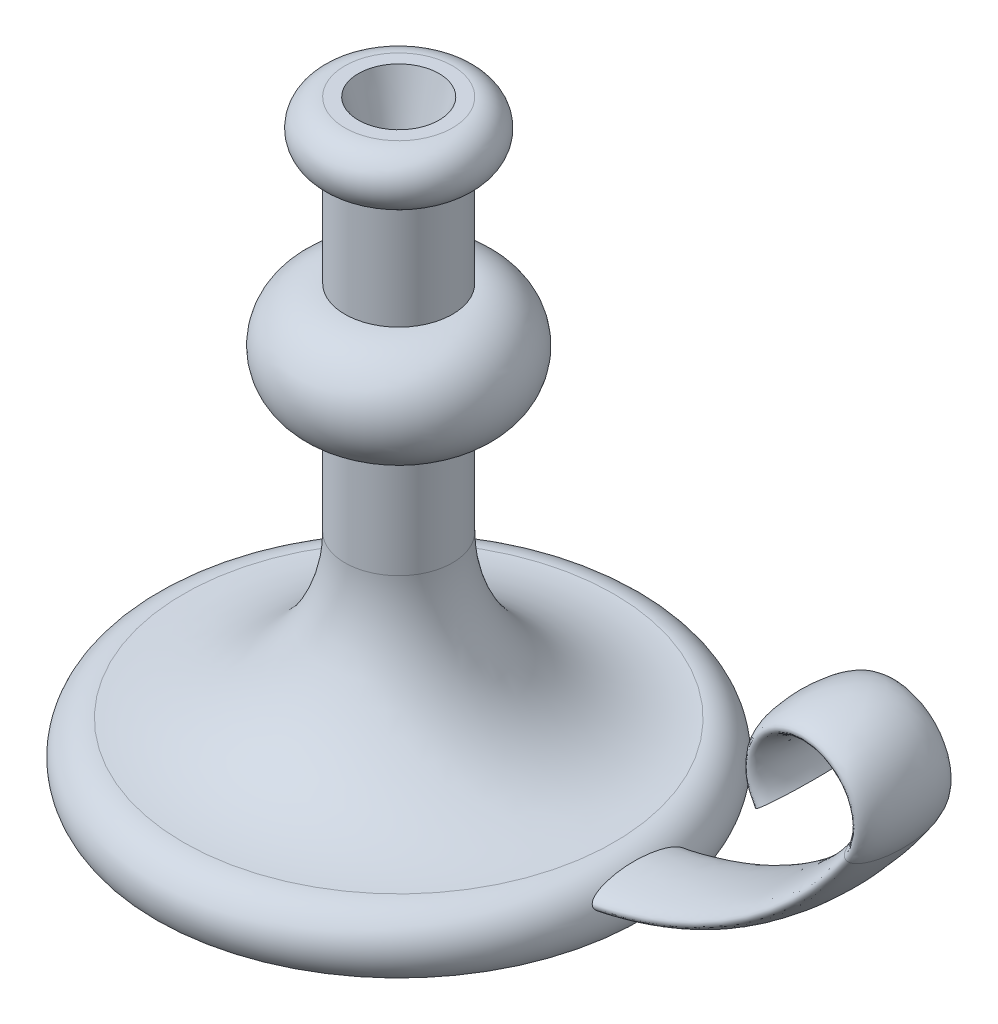
ISO-10303-21;
HEADER;
FILE_DESCRIPTION(('STEP AP214'),'2;1');
FILE_NAME('part.step','',(''),(''),'','','');
FILE_SCHEMA(('AUTOMOTIVE_DESIGN { 1 0 10303 214 1 1 1 1 }'));
ENDSEC;
DATA;
#1=APPLICATION_CONTEXT('core data for automotive mechanical design processes');
#2=APPLICATION_PROTOCOL_DEFINITION('international standard','automotive_design',2000,#1);
#3=PRODUCT_CONTEXT('',#1,'mechanical');
#4=PRODUCT('Part','Part','',(#3));
#5=PRODUCT_RELATED_PRODUCT_CATEGORY('part','',(#4));
#6=PRODUCT_DEFINITION_FORMATION('','',#4);
#7=PRODUCT_DEFINITION_CONTEXT('part definition',#1,'design');
#8=PRODUCT_DEFINITION('design','',#6,#7);
#9=PRODUCT_DEFINITION_SHAPE('','',#8);
#10=(LENGTH_UNIT() NAMED_UNIT(*) SI_UNIT(.MILLI.,.METRE.));
#11=(NAMED_UNIT(*) PLANE_ANGLE_UNIT() SI_UNIT($,.RADIAN.));
#12=(NAMED_UNIT(*) SI_UNIT($,.STERADIAN.) SOLID_ANGLE_UNIT());
#13=UNCERTAINTY_MEASURE_WITH_UNIT(LENGTH_MEASURE(1.E-05),#10,'distance_accuracy_value','');
#14=(GEOMETRIC_REPRESENTATION_CONTEXT(3) GLOBAL_UNCERTAINTY_ASSIGNED_CONTEXT((#13)) GLOBAL_UNIT_ASSIGNED_CONTEXT((#10,
#11,#12)) REPRESENTATION_CONTEXT('',''));
#15=CARTESIAN_POINT('',(0.,0.,0.));
#16=DIRECTION('',(0.,0.,1.));
#17=DIRECTION('',(1.,0.,0.));
#18=AXIS2_PLACEMENT_3D('',#15,#16,#17);
#19=CARTESIAN_POINT('',(0.,0.,0.));
#20=DIRECTION('',(0.,-1.,0.));
#21=DIRECTION('',(0.,0.,-1.));
#22=AXIS2_PLACEMENT_3D('',#19,#20,#21);
#23=PLANE('',#22);
#24=CARTESIAN_POINT('',(0.,0.,0.));
#25=DIRECTION('',(0.,-1.,0.));
#26=DIRECTION('',(0.,0.,-1.));
#27=AXIS2_PLACEMENT_3D('',#24,#25,#26);
#28=CIRCLE('',#27,90.);
#29=CARTESIAN_POINT('',(0.,0.,-90.));
#30=VERTEX_POINT('',#29);
#31=EDGE_CURVE('E76',#30,#30,#28,.T.);
#32=ORIENTED_EDGE('',*,*,#31,.T.);
#33=EDGE_LOOP('',(#32));
#34=FACE_BOUND('',#33,.T.);
#35=ADVANCED_FACE('F36',(#34),#23,.T.);
#36=CARTESIAN_POINT('',(0.,220.,0.));
#37=DIRECTION('',(0.,1.,0.));
#38=DIRECTION('',(0.,0.,1.));
#39=AXIS2_PLACEMENT_3D('',#36,#37,#38);
#40=PLANE('',#39);
#41=CARTESIAN_POINT('',(0.,220.,0.));
#42=DIRECTION('',(0.,1.,0.));
#43=DIRECTION('',(0.,0.,1.));
#44=AXIS2_PLACEMENT_3D('',#41,#42,#43);
#45=CIRCLE('',#44,15.);
#46=CARTESIAN_POINT('',(0.,220.,15.));
#47=VERTEX_POINT('',#46);
#48=EDGE_CURVE('E92',#47,#47,#45,.T.);
#49=ORIENTED_EDGE('',*,*,#48,.F.);
#50=EDGE_LOOP('',(#49));
#51=FACE_BOUND('',#50,.T.);
#52=CARTESIAN_POINT('',(0.,220.,0.));
#53=DIRECTION('',(0.,-1.,0.));
#54=DIRECTION('',(0.,0.,-1.));
#55=AXIS2_PLACEMENT_3D('',#52,#53,#54);
#56=CIRCLE('',#55,20.);
#57=CARTESIAN_POINT('',(0.,220.,-20.));
#58=VERTEX_POINT('',#57);
#59=EDGE_CURVE('E48',#58,#58,#56,.T.);
#60=ORIENTED_EDGE('',*,*,#59,.F.);
#61=EDGE_LOOP('',(#60));
#62=FACE_BOUND('',#61,.T.);
#63=ADVANCED_FACE('F99',(#51,#62),#40,.T.);
#64=CARTESIAN_POINT('',(0.,210.,0.));
#65=DIRECTION('',(0.,-1.,0.));
#66=DIRECTION('',(0.,0.,-1.));
#67=AXIS2_PLACEMENT_3D('',#64,#65,#66);
#68=TOROIDAL_SURFACE('',#67,20.,9.99999999999999);
#69=ORIENTED_EDGE('',*,*,#59,.T.);
#70=EDGE_LOOP('',(#69));
#71=FACE_BOUND('',#70,.T.);
#72=CARTESIAN_POINT('',(0.,200.,0.));
#73=DIRECTION('',(0.,-1.,0.));
#74=DIRECTION('',(0.,0.,-1.));
#75=AXIS2_PLACEMENT_3D('',#72,#73,#74);
#76=CIRCLE('',#75,20.);
#77=CARTESIAN_POINT('',(0.,200.,-20.));
#78=VERTEX_POINT('',#77);
#79=EDGE_CURVE('E53',#78,#78,#76,.T.);
#80=ORIENTED_EDGE('',*,*,#79,.F.);
#81=EDGE_LOOP('',(#80));
#82=FACE_BOUND('',#81,.T.);
#83=ADVANCED_FACE('F102',(#71,#82),#68,.T.);
#84=CARTESIAN_POINT('',(0.,0.,0.));
#85=DIRECTION('',(0.,-1.,0.));
#86=DIRECTION('',(0.,0.,-1.));
#87=AXIS2_PLACEMENT_3D('',#84,#85,#86);
#88=CYLINDRICAL_SURFACE('',#87,20.);
#89=ORIENTED_EDGE('',*,*,#79,.T.);
#90=EDGE_LOOP('',(#89));
#91=FACE_BOUND('',#90,.T.);
#92=CARTESIAN_POINT('',(0.,160.,0.));
#93=DIRECTION('',(0.,-1.,0.));
#94=DIRECTION('',(0.,0.,-1.));
#95=AXIS2_PLACEMENT_3D('',#92,#93,#94);
#96=CIRCLE('',#95,20.);
#97=CARTESIAN_POINT('',(0.,160.,-20.));
#98=VERTEX_POINT('',#97);
#99=EDGE_CURVE('E58',#98,#98,#96,.T.);
#100=ORIENTED_EDGE('',*,*,#99,.F.);
#101=EDGE_LOOP('',(#100));
#102=FACE_BOUND('',#101,.T.);
#103=ADVANCED_FACE('F107',(#91,#102),#88,.T.);
#104=CARTESIAN_POINT('',(0.,140.,0.));
#105=DIRECTION('',(0.,-1.,0.));
#106=DIRECTION('',(0.,0.,-1.));
#107=AXIS2_PLACEMENT_3D('',#104,#105,#106);
#108=TOROIDAL_SURFACE('',#107,20.,20.);
#109=ORIENTED_EDGE('',*,*,#99,.T.);
#110=EDGE_LOOP('',(#109));
#111=FACE_BOUND('',#110,.T.);
#112=CARTESIAN_POINT('',(0.,120.,0.));
#113=DIRECTION('',(0.,-1.,0.));
#114=DIRECTION('',(0.,0.,-1.));
#115=AXIS2_PLACEMENT_3D('',#112,#113,#114);
#116=CIRCLE('',#115,20.);
#117=CARTESIAN_POINT('',(0.,120.,-20.));
#118=VERTEX_POINT('',#117);
#119=EDGE_CURVE('E64',#118,#118,#116,.T.);
#120=ORIENTED_EDGE('',*,*,#119,.F.);
#121=EDGE_LOOP('',(#120));
#122=FACE_BOUND('',#121,.T.);
#123=ADVANCED_FACE('F113',(#111,#122),#108,.T.);
#124=CARTESIAN_POINT('',(0.,0.,0.));
#125=DIRECTION('',(0.,-1.,0.));
#126=DIRECTION('',(0.,0.,-1.));
#127=AXIS2_PLACEMENT_3D('',#124,#125,#126);
#128=CYLINDRICAL_SURFACE('',#127,20.);
#129=ORIENTED_EDGE('',*,*,#119,.T.);
#130=EDGE_LOOP('',(#129));
#131=FACE_BOUND('',#130,.T.);
#132=CARTESIAN_POINT('',(0.,80.,0.));
#133=DIRECTION('',(0.,-1.,0.));
#134=DIRECTION('',(0.,0.,-1.));
#135=AXIS2_PLACEMENT_3D('',#132,#133,#134);
#136=CIRCLE('',#135,20.);
#137=CARTESIAN_POINT('',(0.,80.,-20.));
#138=VERTEX_POINT('',#137);
#139=EDGE_CURVE('E68',#138,#138,#136,.T.);
#140=ORIENTED_EDGE('',*,*,#139,.F.);
#141=EDGE_LOOP('',(#140));
#142=FACE_BOUND('',#141,.T.);
#143=ADVANCED_FACE('F117',(#131,#142),#128,.T.);
#144=CARTESIAN_POINT('',(0.,80.,0.));
#145=DIRECTION('',(0.,-1.,0.));
#146=DIRECTION('',(0.,0.,-1.));
#147=AXIS2_PLACEMENT_3D('',#144,#145,#146);
#148=TOROIDAL_SURFACE('',#147,80.,60.);
#149=ORIENTED_EDGE('',*,*,#139,.T.);
#150=EDGE_LOOP('',(#149));
#151=FACE_BOUND('',#150,.T.);
#152=CARTESIAN_POINT('',(0.,20.,0.));
#153=DIRECTION('',(0.,-1.,0.));
#154=DIRECTION('',(0.,0.,-1.));
#155=AXIS2_PLACEMENT_3D('',#152,#153,#154);
#156=CIRCLE('',#155,80.);
#157=CARTESIAN_POINT('',(0.,20.,-80.));
#158=VERTEX_POINT('',#157);
#159=EDGE_CURVE('E72',#158,#158,#156,.T.);
#160=ORIENTED_EDGE('',*,*,#159,.F.);
#161=EDGE_LOOP('',(#160));
#162=FACE_BOUND('',#161,.T.);
#163=ADVANCED_FACE('F121',(#151,#162),#148,.F.);
#164=CARTESIAN_POINT('',(0.,7.50000000000004,0.));
#165=DIRECTION('',(0.,-1.,0.));
#166=DIRECTION('',(0.,0.,-1.));
#167=AXIS2_PLACEMENT_3D('',#164,#165,#166);
#168=TOROIDAL_SURFACE('',#167,80.,12.5);
#169=CARTESIAN_POINT('',(89.5597422043342,12.9414346567555,17.5));
#170=CARTESIAN_POINT('',(89.5807278946486,12.8988393157081,17.5000019534777));
#171=CARTESIAN_POINT('',(89.6018125795404,12.8563039357769,17.4977816975197));
#172=CARTESIAN_POINT('',(89.6440155813563,12.7716938339371,17.489002543543));
#173=CARTESIAN_POINT('',(89.6651339056647,12.7296192360718,17.4824425050804));
#174=CARTESIAN_POINT('',(89.7283289297819,12.6045076597417,17.4565216692095));
#175=CARTESIAN_POINT('',(89.7702246464785,12.5226255894255,17.4309204730636));
#176=CARTESIAN_POINT('',(89.8644276523311,12.3407735771966,17.3563532007827));
#177=CARTESIAN_POINT('',(89.9162117483189,12.242484901666,17.3027527423027));
#178=CARTESIAN_POINT('',(90.0163878681401,12.0551458272008,17.178826321144));
#179=CARTESIAN_POINT('',(90.0647710548457,11.966119226993,17.1084587296403));
#180=CARTESIAN_POINT('',(90.1524531790239,11.806984522925,16.9652391551481));
#181=CARTESIAN_POINT('',(90.1921458014336,11.7358878994478,16.8936963434585));
#182=CARTESIAN_POINT('',(90.2690886261224,11.5996259068224,16.7438969488311));
#183=CARTESIAN_POINT('',(90.3063367280021,11.5344656201532,16.665634722265));
#184=CARTESIAN_POINT('',(90.3786756485819,11.4092540815105,16.5039763875564));
#185=CARTESIAN_POINT('',(90.4137624747614,11.349212210629,16.4205713158718));
#186=CARTESIAN_POINT('',(90.4819450166471,11.2336894025401,16.2499454917114));
#187=CARTESIAN_POINT('',(90.5150413047902,11.1782071523834,16.162725848809));
#188=CARTESIAN_POINT('',(90.5839705930101,11.0637251825689,15.9728919395736));
#189=CARTESIAN_POINT('',(90.6195406839562,11.0053156128849,15.8698282905887));
#190=CARTESIAN_POINT('',(90.6886668526269,10.8929143897208,15.6606649910658));
#191=CARTESIAN_POINT('',(90.7222226971282,10.8389232475745,15.5545649910506));
#192=CARTESIAN_POINT('',(90.787486486134,10.7348751403119,15.3401290691865));
#193=CARTESIAN_POINT('',(90.8191972688173,10.6848120890841,15.2317969483067));
#194=CARTESIAN_POINT('',(90.881005962979,10.5880683385414,15.0131968985225));
#195=CARTESIAN_POINT('',(90.9111039714558,10.5413874357516,14.9029290865686));
#196=CARTESIAN_POINT('',(90.9798973633521,10.4355491517098,14.6427529331226));
#197=CARTESIAN_POINT('',(91.0180072010884,10.377593665576,14.4922012075481));
#198=CARTESIAN_POINT('',(91.091887555317,10.2663462891692,14.1888070722871));
#199=CARTESIAN_POINT('',(91.1276577411367,10.2130550577559,14.0359643425398));
#200=CARTESIAN_POINT('',(91.1971197458645,10.1105127689612,13.7282685712581));
#201=CARTESIAN_POINT('',(91.2308091946811,10.0612662985098,13.573413471871));
#202=CARTESIAN_POINT('',(91.2962483962878,9.96642044574798,13.262180104172));
#203=CARTESIAN_POINT('',(91.3279980241889,9.92082129819992,13.1058017385396));
#204=CARTESIAN_POINT('',(91.4205951755327,9.78887458660799,12.6346162266685));
#205=CARTESIAN_POINT('',(91.4787589060981,9.70742476979595,12.3179025042442));
#206=CARTESIAN_POINT('',(91.5890957852254,9.55493826130152,11.6792188898602));
#207=CARTESIAN_POINT('',(91.641236506382,9.48395741425906,11.357230318611));
#208=CARTESIAN_POINT('',(91.7397682682944,9.35136221163197,10.7107316640823));
#209=CARTESIAN_POINT('',(91.7861636672357,9.28974074823245,10.3862236929834));
#210=CARTESIAN_POINT('',(91.8736976604511,9.17463718318053,9.73512886653571));
#211=CARTESIAN_POINT('',(91.9148370779327,9.12115380666537,9.40854234516816));
#212=CARTESIAN_POINT('',(91.9930777751443,9.02031209920319,8.74630339912615));
#213=CARTESIAN_POINT('',(92.0300669877613,8.9731192113716,8.41061269264338));
#214=CARTESIAN_POINT('',(92.0991833927575,8.88559842477435,7.73783252743946));
#215=CARTESIAN_POINT('',(92.1313104056236,8.84527077946752,7.40074301754612));
#216=CARTESIAN_POINT('',(92.1909161961866,8.77092313439269,6.72537142355346));
#217=CARTESIAN_POINT('',(92.2183937480205,8.73690479789183,6.38708904887192));
#218=CARTESIAN_POINT('',(92.2688480816039,8.67476840304501,5.70964427774291));
#219=CARTESIAN_POINT('',(92.2918247141674,8.64665054027193,5.37048185250299));
#220=CARTESIAN_POINT('',(92.3540877228587,8.57076604630488,4.35367181244669));
#221=CARTESIAN_POINT('',(92.3868571977359,8.53128338370556,3.67498389641647));
#222=CARTESIAN_POINT('',(92.4356134743347,8.47274161832896,2.3161471150407));
#223=CARTESIAN_POINT('',(92.4515998737813,8.45368300509716,1.63599821506823));
#224=CARTESIAN_POINT('',(92.4661200478781,8.43637339284855,0.357955102331944));
#225=CARTESIAN_POINT('',(92.4665389208555,8.43587490179708,-0.239888856143656));
#226=CARTESIAN_POINT('',(92.4546362797528,8.4500624126083,-1.43536153859164));
#227=CARTESIAN_POINT('',(92.4423128974783,8.46475064105845,-2.03299021814842));
#228=CARTESIAN_POINT('',(92.4047541650815,8.5097668077993,-3.22745109478543));
#229=CARTESIAN_POINT('',(92.379514731688,8.54009969200438,-3.82428298010724));
#230=CARTESIAN_POINT('',(92.3157217367253,8.61743320229677,-5.0169460623326));
#231=CARTESIAN_POINT('',(92.2771508465328,8.66445552395921,-5.6127749375613));
#232=CARTESIAN_POINT('',(92.1861026743767,8.77678784246257,-6.80153886380939));
#233=CARTESIAN_POINT('',(92.1336290020919,8.842093092625,-7.39447462535091));
#234=CARTESIAN_POINT('',(92.0437550848418,8.95574227206712,-8.28055229820513));
#235=CARTESIAN_POINT('',(92.0119455213755,8.99622894552014,-8.57528682166726));
#236=CARTESIAN_POINT('',(91.9444204496405,9.08291539794889,-9.16346094428884));
#237=CARTESIAN_POINT('',(91.9087051114866,9.12911492811459,-9.45690059926715));
#238=CARTESIAN_POINT('',(91.8331309715698,9.2278292933407,-10.0422906036683));
#239=CARTESIAN_POINT('',(91.7932707518514,9.28034629056384,-10.3342404073468));
#240=CARTESIAN_POINT('',(91.709117916737,9.39245062081631,-10.9161852811052));
#241=CARTESIAN_POINT('',(91.6648247441272,9.45203884286031,-11.2061801005452));
#242=CARTESIAN_POINT('',(91.5713925727481,9.57931645333881,-11.7838191658168));
#243=CARTESIAN_POINT('',(91.5222504482682,9.64701107336926,-12.0714617643072));
#244=CARTESIAN_POINT('',(91.4186796874406,9.79172730085907,-12.6430805537631));
#245=CARTESIAN_POINT('',(91.3642572573635,9.86873798424095,-12.9270606150355));
#246=CARTESIAN_POINT('',(91.2493765391175,10.033952974788,-13.4904217181466));
#247=CARTESIAN_POINT('',(91.1889212109097,10.1221517983454,-13.7698049377448));
#248=CARTESIAN_POINT('',(91.0929373870874,10.2648274882363,-14.1839125047646));
#249=CARTESIAN_POINT('',(91.0600757486262,10.3140904181849,-14.3210581267386));
#250=CARTESIAN_POINT('',(90.9923938569386,10.4165511027192,-14.5933763477649));
#251=CARTESIAN_POINT('',(90.9575737807137,10.4697485018484,-14.7285491237344));
#252=CARTESIAN_POINT('',(90.8810851838777,10.5878451344079,-15.0138774923677));
#253=CARTESIAN_POINT('',(90.8391147723957,10.6533666208412,-15.1636969104748));
#254=CARTESIAN_POINT('',(90.7519625692612,10.7912189771815,-15.45932953559));
#255=CARTESIAN_POINT('',(90.7067794219569,10.8635527258308,-15.6051410149849));
#256=CARTESIAN_POINT('',(90.6128939496975,11.0160439629677,-15.8905749729623));
#257=CARTESIAN_POINT('',(90.5642084544311,11.0961646105686,-16.0302224467125));
#258=CARTESIAN_POINT('',(90.4624897667354,11.2662530107873,-16.3016394850687));
#259=CARTESIAN_POINT('',(90.4094613083908,11.3562100760682,-16.4334173639364));
#260=CARTESIAN_POINT('',(90.3114276481005,11.5255085385048,-16.6553108138959));
#261=CARTESIAN_POINT('',(90.2675273757817,11.6022608890606,-16.747864447136));
#262=CARTESIAN_POINT('',(90.1761749534326,11.7643292238687,-16.9236630994732));
#263=CARTESIAN_POINT('',(90.1287172073378,11.849658775493,-17.0068929161981));
#264=CARTESIAN_POINT('',(90.0292807633426,12.0313291797368,-17.160728121925));
#265=CARTESIAN_POINT('',(89.9772518064337,12.1277974407354,-17.2311575389091));
#266=CARTESIAN_POINT('',(89.8965437818878,12.2800613987942,-17.3212876850735));
#267=CARTESIAN_POINT('',(89.8692277989253,12.3320164153137,-17.3487242132161));
#268=CARTESIAN_POINT('',(89.8138320311432,12.4382955168478,-17.3975211145679));
#269=CARTESIAN_POINT('',(89.7857527202502,12.4926181439799,-17.4188851676711));
#270=CARTESIAN_POINT('',(89.7185869780336,12.6237048005599,-17.4611772226903));
#271=CARTESIAN_POINT('',(89.6792533408887,12.7013692224277,-17.4790502108363));
#272=CARTESIAN_POINT('',(89.6005512815564,12.8586256339485,-17.4997317533412));
#273=CARTESIAN_POINT('',(89.5611829132234,12.9382160139949,-17.5025524785485));
#274=CARTESIAN_POINT('',(89.4835317885697,13.0969633423244,-17.4927372657774));
#275=CARTESIAN_POINT('',(89.4452490812937,13.1761202708964,-17.4801006306501));
#276=CARTESIAN_POINT('',(89.3707047667355,13.3318071774563,-17.440649407729));
#277=CARTESIAN_POINT('',(89.3344452993772,13.4083343423531,-17.4138201116179));
#278=CARTESIAN_POINT('',(89.2510611220235,13.5858554385683,-17.3357126521072));
#279=CARTESIAN_POINT('',(89.2050998650832,13.684982377722,-17.2790047620841));
#280=CARTESIAN_POINT('',(89.1180744174557,13.874427631182,-17.1491670423827));
#281=CARTESIAN_POINT('',(89.0770301058259,13.9647099356686,-17.0759737821298));
#282=CARTESIAN_POINT('',(89.0037033744712,14.1271434857571,-16.927057730704));
#283=CARTESIAN_POINT('',(88.9709541551904,14.2001945680732,-16.8525208708986));
#284=CARTESIAN_POINT('',(88.9084968426191,14.3401811690449,-16.6970292692111));
#285=CARTESIAN_POINT('',(88.8787841266134,14.4071259665769,-16.6160846261893));
#286=CARTESIAN_POINT('',(88.8217814388549,14.5359995630883,-16.4490709627679));
#287=CARTESIAN_POINT('',(88.7944998605827,14.5979109242412,-16.3629857823211));
#288=CARTESIAN_POINT('',(88.742066743737,14.717173406466,-16.1870697873632));
#289=CARTESIAN_POINT('',(88.7169159331092,14.7745229686601,-16.0972377082951));
#290=CARTESIAN_POINT('',(88.6682699235337,14.8855899090512,-15.9140699306463));
#291=CARTESIAN_POINT('',(88.6447869137156,14.9392804489426,-15.820714827906));
#292=CARTESIAN_POINT('',(88.5993971939428,15.0431008843882,-15.6316626961434));
#293=CARTESIAN_POINT('',(88.5774907604158,15.0932301555102,-15.5359652603525));
#294=CARTESIAN_POINT('',(88.5137514786221,15.2390285874186,-15.2458062448788));
#295=CARTESIAN_POINT('',(88.4739596847914,15.3299685477359,-15.0485147207848));
#296=CARTESIAN_POINT('',(88.3985337506615,15.5017775203626,-14.6487152633389));
#297=CARTESIAN_POINT('',(88.362902963484,15.582638414004,-14.4462032813475));
#298=CARTESIAN_POINT('',(88.2948356711212,15.7363066128672,-14.0365764701691));
#299=CARTESIAN_POINT('',(88.262414229517,15.8090761199816,-13.8294450545351));
#300=CARTESIAN_POINT('',(88.2003835751382,15.9473648801957,-13.4126289871761));
#301=CARTESIAN_POINT('',(88.1707714189814,16.0128917338223,-13.2029472733583));
#302=CARTESIAN_POINT('',(88.1139049361938,16.1377375745621,-12.7814949946301));
#303=CARTESIAN_POINT('',(88.0866500408509,16.1970580597504,-12.5697249473628));
#304=CARTESIAN_POINT('',(88.027617257203,16.3244235662305,-12.0912931700778));
#305=CARTESIAN_POINT('',(87.9964138193045,16.3909381265495,-11.8241540502344));
#306=CARTESIAN_POINT('',(87.9367717636617,16.516593676472,-11.2878278414649));
#307=CARTESIAN_POINT('',(87.9083334164422,16.5757339447661,-11.0186405549273));
#308=CARTESIAN_POINT('',(87.8539266282972,16.6875098948957,-10.4785408424881));
#309=CARTESIAN_POINT('',(87.8279593730488,16.7401424577996,-10.2076276543192));
#310=CARTESIAN_POINT('',(87.7783184309332,16.8395301522937,-9.66451167999812));
#311=CARTESIAN_POINT('',(87.7546448506396,16.8862850108118,-9.39230883453907));
#312=CARTESIAN_POINT('',(87.6869994555325,17.0182803050949,-8.5757896592177));
#313=CARTESIAN_POINT('',(87.6462388525847,17.0955854003688,-8.02991167225434));
#314=CARTESIAN_POINT('',(87.5728065515612,17.2320145687303,-6.93552385093978));
#315=CARTESIAN_POINT('',(87.5401330675683,17.2911426566328,-6.38701462498065));
#316=CARTESIAN_POINT('',(87.4828441952971,17.3930876120975,-5.28955884850878));
#317=CARTESIAN_POINT('',(87.4582074588681,17.4359477429323,-4.74061740412531));
#318=CARTESIAN_POINT('',(87.4169410999172,17.5068884934702,-3.64146108218719));
#319=CARTESIAN_POINT('',(87.4003119088603,17.5349683167839,-3.09124613761811));
#320=CARTESIAN_POINT('',(87.375169948199,17.5771566462025,-1.98980868969242));
#321=CARTESIAN_POINT('',(87.3666614689744,17.5912577671532,-1.43858580772155));
#322=CARTESIAN_POINT('',(87.3578539704596,17.6058511840596,-0.335909067645893));
#323=CARTESIAN_POINT('',(87.3575547550007,17.6063438052041,0.215544784624726));
#324=CARTESIAN_POINT('',(87.3651677510508,17.5937352162513,1.3181582277618));
#325=CARTESIAN_POINT('',(87.3730787250644,17.5806360547996,1.86931785045029));
#326=CARTESIAN_POINT('',(87.3970372477743,17.5404868292747,2.97097544677656));
#327=CARTESIAN_POINT('',(87.4130850653538,17.5134363041761,3.52147339794669));
#328=CARTESIAN_POINT('',(87.4531996813082,17.4446213827576,4.6211213566672));
#329=CARTESIAN_POINT('',(87.4772644593792,17.402860693302,5.1702716687407));
#330=CARTESIAN_POINT('',(87.5333316774061,17.3033707612732,6.26670053623457));
#331=CARTESIAN_POINT('',(87.5653334299481,17.2456429015516,6.81397924959306));
#332=CARTESIAN_POINT('',(87.6208220531231,17.1429049509085,7.65503321383689));
#333=CARTESIAN_POINT('',(87.641467966926,17.1042333246741,7.94978028808818));
#334=CARTESIAN_POINT('',(87.6851649593456,17.0212250701555,8.5382946276216));
#335=CARTESIAN_POINT('',(87.708215967875,16.9768886069428,8.83206192119839));
#336=CARTESIAN_POINT('',(87.7568106691337,16.882051036968,9.41827197236836));
#337=CARTESIAN_POINT('',(87.7823533406001,16.8315524537746,9.71071522164786));
#338=CARTESIAN_POINT('',(87.8360989952265,16.723719368105,10.2940938312746));
#339=CARTESIAN_POINT('',(87.8643018909557,16.6663850902742,10.5850292408472));
#340=CARTESIAN_POINT('',(87.9147712499548,16.5622842610505,11.0784529887221));
#341=CARTESIAN_POINT('',(87.9362980252954,16.5174691899791,11.2814293835332));
#342=CARTESIAN_POINT('',(87.9809118301304,16.4236835134752,11.6862455623073));
#343=CARTESIAN_POINT('',(88.0039988123354,16.3747130339804,11.8880853805189));
#344=CARTESIAN_POINT('',(88.0519198244943,16.2721215384761,12.2905621648841));
#345=CARTESIAN_POINT('',(88.0767553337324,16.218496575543,12.4911979528411));
#346=CARTESIAN_POINT('',(88.1283787004668,16.106070784734,12.8907612736835));
#347=CARTESIAN_POINT('',(88.1551664933023,16.0472701282665,13.0896888629017));
#348=CARTESIAN_POINT('',(88.2109999780505,15.9237718205578,13.4854201231408));
#349=CARTESIAN_POINT('',(88.2400459194858,15.8590735174966,13.6822235567007));
#350=CARTESIAN_POINT('',(88.3008027999433,15.7228691935853,14.0730419872894));
#351=CARTESIAN_POINT('',(88.3325134779585,15.6513638393845,14.2670572552399));
#352=CARTESIAN_POINT('',(88.399142454196,15.500394811586,14.6511973591136));
#353=CARTESIAN_POINT('',(88.4340575115816,15.4209391715426,14.841325893066));
#354=CARTESIAN_POINT('',(88.5079196083049,15.2523848762565,15.2164401400169));
#355=CARTESIAN_POINT('',(88.5468648114131,15.163290611765,15.4014281468491));
#356=CARTESIAN_POINT('',(88.6092096238852,15.020657971887,15.6733114229643));
#357=CARTESIAN_POINT('',(88.6306485895102,14.9716086740025,15.7630166800371));
#358=CARTESIAN_POINT('',(88.6750422753313,14.8701248615221,15.9401002079373));
#359=CARTESIAN_POINT('',(88.6979967332497,14.8176909327199,16.0274788777599));
#360=CARTESIAN_POINT('',(88.7456840101799,14.7089478844275,16.1993887567133));
#361=CARTESIAN_POINT('',(88.770417968827,14.6526362825892,16.2839180892542));
#362=CARTESIAN_POINT('',(88.8219484857479,14.5356422617905,16.4492391224753));
#363=CARTESIAN_POINT('',(88.8487445345048,14.4749609227745,16.5300317386029));
#364=CARTESIAN_POINT('',(88.8976102788187,14.364743484895,16.6667168433049));
#365=CARTESIAN_POINT('',(88.919137419161,14.3163230322081,16.7236955334945));
#366=CARTESIAN_POINT('',(88.9637080676469,14.2164452982159,16.8342912802673));
#367=CARTESIAN_POINT('',(88.9867519478514,14.1649872721063,16.8879075056816));
#368=CARTESIAN_POINT('',(89.0583610181501,14.0058008216797,17.0423310846555));
#369=CARTESIAN_POINT('',(89.1095289234105,13.8929758416957,17.1370796109724));
#370=CARTESIAN_POINT('',(89.1999001554575,13.6963386208974,17.2707956184665));
#371=CARTESIAN_POINT('',(89.2367505169322,13.6167644879683,17.317550348063));
#372=CARTESIAN_POINT('',(89.3136877653851,13.4522974166011,17.3968468737186));
#373=CARTESIAN_POINT('',(89.3537667767867,13.3674175273965,17.4294220837181));
#374=CARTESIAN_POINT('',(89.4217091217893,13.2251848973542,17.4685967336683));
#375=CARTESIAN_POINT('',(89.448809384098,13.1688551716176,17.4803204652976));
#376=CARTESIAN_POINT('',(89.503794774035,13.0554594934971,17.4960211898048));
#377=CARTESIAN_POINT('',(89.5316799819,12.9983934661741,17.499997387795));
#378=CARTESIAN_POINT('',(89.5597422043342,12.9414346567555,17.5));
#379=B_SPLINE_CURVE_WITH_KNOTS('',3,(#169,#170,#171,#172,#173,#174,#175,#176,#177,#178,#179,
#180,#181,#182,#183,#184,#185,#186,#187,#188,#189,#190,#191,#192,#193,#194,#195,#196,#197,#198,
#199,#200,#201,#202,#203,#204,#205,#206,#207,#208,#209,#210,#211,#212,#213,#214,#215,#216,#217,
#218,#219,#220,#221,#222,#223,#224,#225,#226,#227,#228,#229,#230,#231,#232,#233,#234,#235,#236,
#237,#238,#239,#240,#241,#242,#243,#244,#245,#246,#247,#248,#249,#250,#251,#252,#253,#254,#255,
#256,#257,#258,#259,#260,#261,#262,#263,#264,#265,#266,#267,#268,#269,#270,#271,#272,#273,#274,
#275,#276,#277,#278,#279,#280,#281,#282,#283,#284,#285,#286,#287,#288,#289,#290,#291,#292,#293,
#294,#295,#296,#297,#298,#299,#300,#301,#302,#303,#304,#305,#306,#307,#308,#309,#310,#311,#312,
#313,#314,#315,#316,#317,#318,#319,#320,#321,#322,#323,#324,#325,#326,#327,#328,#329,#330,#331,
#332,#333,#334,#335,#336,#337,#338,#339,#340,#341,#342,#343,#344,#345,#346,#347,#348,#349,#350,
#351,#352,#353,#354,#355,#356,#357,#358,#359,#360,#361,#362,#363,#364,#365,#366,#367,#368,#369,
#370,#371,#372,#373,#374,#375,#376,#377,#378),.UNSPECIFIED.,.T.,.F.,(4,2,2,2,2,2,2,2,2,2,2,2,2,
2,2,2,2,2,2,2,2,2,2,2,2,2,2,2,2,2,2,2,2,2,2,2,2,2,2,2,2,2,2,2,2,2,2,2,2,2,2,2,2,2,2,2,2,2,2,2,2,
2,2,2,2,2,2,2,2,2,2,2,2,2,2,2,2,2,2,2,2,2,2,2,2,2,2,2,2,2,2,2,2,2,2,2,2,2,2,2,2,2,2,2,4),(0.,
0.142381357158816,0.28480014533879,0.56977836971037,0.937790990160506,1.30672699797602,
1.63143353328552,1.95641550824169,2.28198085179475,2.6074521174453,2.97835758825746,
3.34930592253142,3.71966767593574,4.09000712931063,4.58717127025776,5.08440552627602,
5.5821960973042,6.08001868322203,7.07612740491147,8.07737111401415,9.07785060328476,
10.0781732018629,11.1010679437462,12.1240004418369,13.1472022244407,14.1704379160043,
16.2117115539474,18.2530341182273,20.0462457692419,21.839720367684,23.6337623045226,
25.4301450150665,27.2260617741974,28.1235892294177,29.0210776087003,29.9188740333847,
30.8167834514321,31.7152755049921,32.6127240115718,33.5097343419003,33.9578247270815,
34.4058746792329,34.9121604747938,35.4186611861169,35.9228725276491,36.4265413835618,
36.8100240505595,37.1941231504199,37.5831580539592,37.7772586450041,37.9712413599168,
38.2366258142317,38.5017956533799,38.7669774525069,39.0324346081148,39.3996555983548,
39.7683144393121,40.0959866375239,40.4231523204128,40.7514069982212,41.0797733710077,
41.4103344436379,41.7409533344653,42.403033956627,43.0656444835732,43.7312306850951,
44.3961116446154,45.0608317450503,45.8918608553078,46.7229711882499,47.5544783139756,
48.3860240564149,50.0440426041174,51.701694676301,53.3549069476184,55.0082082878449,
56.6623826267331,58.3165174374175,59.9704029618918,61.6243431428198,63.2778668395629,
64.9312473761663,65.8251617717402,66.7190501248689,67.6125736254207,68.5060677696834,
69.1329546330664,69.7598225042291,70.3872272415089,71.0146112082211,71.6420645989512,
72.2694566030657,72.896220926345,73.5227009279516,73.8360175198393,74.1492800292298,
74.4627449766594,74.7761327179491,75.009418944319,75.2427626113341,75.7080186392217,
76.0052441465112,76.301765401324,76.4921392885518,76.6825327068869),.UNSPECIFIED.);
#380=CARTESIAN_POINT('',(89.5597422043342,12.9414346567555,17.5));
#381=VERTEX_POINT('',#380);
#382=EDGE_CURVE('E10',#381,#381,#379,.T.);
#383=ORIENTED_EDGE('',*,*,#382,.F.);
#384=EDGE_LOOP('',(#383));
#385=FACE_BOUND('',#384,.T.);
#386=ORIENTED_EDGE('',*,*,#159,.T.);
#387=EDGE_LOOP('',(#386));
#388=FACE_BOUND('',#387,.T.);
#389=ORIENTED_EDGE('',*,*,#31,.F.);
#390=EDGE_LOOP('',(#389));
#391=FACE_BOUND('',#390,.T.);
#392=ADVANCED_FACE('F124',(#385,#388,#391),#168,.T.);
#393=CARTESIAN_POINT('',(150.634185358261,75.,0.));
#394=DIRECTION('',(0.566666666666667,-0.823947139620552,0.));
#395=DIRECTION('',(0.,0.,-1.));
#396=AXIS2_PLACEMENT_3D('',#393,#394,#395);
#397=PLANE('',#396);
#398=CARTESIAN_POINT('',(150.634185358261,75.,0.));
#399=DIRECTION('',(0.566666666666667,-0.823947139620552,0.));
#400=DIRECTION('',(0.,0.,1.));
#401=AXIS2_PLACEMENT_3D('',#398,#399,#400);
#402=ELLIPSE('',#401,17.5,5.);
#403=CARTESIAN_POINT('',(150.634185358261,75.,17.5));
#404=VERTEX_POINT('',#403);
#405=EDGE_CURVE('E80',#404,#404,#402,.T.);
#406=ORIENTED_EDGE('',*,*,#405,.T.);
#407=EDGE_LOOP('',(#406));
#408=FACE_BOUND('',#407,.T.);
#409=ADVANCED_FACE('F129',(#408),#397,.T.);
#410=CARTESIAN_POINT('',(60.,10.,17.5));
#411=CARTESIAN_POINT('',(110.410191303973,10.,17.5));
#412=CARTESIAN_POINT('',(155.026295870831,33.4646670673665,17.5));
#413=CARTESIAN_POINT('',(183.592070943083,74.9999999999999,17.5));
#414=CARTESIAN_POINT('',(60.,0.,17.5));
#415=CARTESIAN_POINT('',(113.770870724238,0.,17.5));
#416=CARTESIAN_POINT('',(161.36138226222,25.0289782051909,17.5));
#417=CARTESIAN_POINT('',(191.831542339288,69.3333333333333,17.5));
#418=CARTESIAN_POINT('',(60.,0.,-17.5));
#419=CARTESIAN_POINT('',(113.770870724238,0.,-17.5));
#420=CARTESIAN_POINT('',(161.36138226222,25.0289782051909,-17.5));
#421=CARTESIAN_POINT('',(191.831542339288,69.3333333333333,-17.5));
#422=CARTESIAN_POINT('',(60.,10.,-17.5));
#423=CARTESIAN_POINT('',(110.410191303973,10.,-17.5));
#424=CARTESIAN_POINT('',(155.026295870831,33.4646670673665,-17.5));
#425=CARTESIAN_POINT('',(183.592070943083,74.9999999999999,-17.5));
#426=CARTESIAN_POINT('',(60.,20.,-17.5));
#427=CARTESIAN_POINT('',(107.049511883708,20.,-17.5));
#428=CARTESIAN_POINT('',(148.691209479442,41.9003559295421,-17.5));
#429=CARTESIAN_POINT('',(175.352599546877,80.6666666666666,-17.5));
#430=CARTESIAN_POINT('',(60.,20.,17.5));
#431=CARTESIAN_POINT('',(107.049511883708,20.,17.5));
#432=CARTESIAN_POINT('',(148.691209479442,41.9003559295421,17.5));
#433=CARTESIAN_POINT('',(175.352599546877,80.6666666666666,17.5));
#434=CARTESIAN_POINT('',(60.,10.,17.5));
#435=CARTESIAN_POINT('',(110.410191303973,10.,17.5));
#436=CARTESIAN_POINT('',(155.026295870831,33.4646670673665,17.5));
#437=CARTESIAN_POINT('',(183.592070943083,74.9999999999999,17.5));
#438=(BOUNDED_SURFACE() B_SPLINE_SURFACE(3,3,((#410,#411,#412,#413),(#414,#415,#416,#417),(#418,
#419,#420,#421),(#422,#423,#424,#425),(#426,#427,#428,#429),(#430,#431,#432,#433),(#434,#435,
#436,#437)),.UNSPECIFIED.,.T.,.F.,.F.) B_SPLINE_SURFACE_WITH_KNOTS((4,3,4),(4,4),(0.,0.5,1.),
(0.,1.),.UNSPECIFIED.) GEOMETRIC_REPRESENTATION_ITEM() RATIONAL_B_SPLINE_SURFACE(((1.,
0.923374135437856,0.923374135437856,1.),(0.333333333333333,0.307791378479285,0.307791378479285,
0.333333333333333),(0.333333333333333,0.307791378479285,0.307791378479285,0.333333333333333),
(1.,0.923374135437856,0.923374135437856,1.),(0.333333333333333,0.307791378479285,
0.307791378479285,0.333333333333333),(0.333333333333333,0.307791378479285,0.307791378479285,
0.333333333333333),(1.,0.923374135437856,0.923374135437856,1.))) REPRESENTATION_ITEM('') SURFACE());
#439=CARTESIAN_POINT('',(183.592070943083,75.,0.));
#440=DIRECTION('',(0.566666666666667,0.823947139620551,0.));
#441=DIRECTION('',(0.,0.,1.));
#442=AXIS2_PLACEMENT_3D('',#439,#440,#441);
#443=ELLIPSE('',#442,17.5,5.);
#444=CARTESIAN_POINT('',(183.592070943083,75.,17.5));
#445=VERTEX_POINT('',#444);
#446=EDGE_CURVE('E84',#445,#445,#443,.T.);
#447=ORIENTED_EDGE('',*,*,#382,.T.);
#448=EDGE_LOOP('',(#447));
#449=FACE_BOUND('',#448,.T.);
#450=ORIENTED_EDGE('',*,*,#446,.F.);
#451=EDGE_LOOP('',(#450));
#452=FACE_BOUND('',#451,.T.);
#453=ADVANCED_FACE('F134',(#449,#452),#438,.T.);
#454=CARTESIAN_POINT('',(183.592070943083,74.9999999999999,17.5));
#455=CARTESIAN_POINT('',(193.981461744242,90.10642735238,17.5));
#456=CARTESIAN_POINT('',(185.447347211541,106.333333333333,17.5));
#457=CARTESIAN_POINT('',(167.113128150672,106.333333333333,17.5));
#458=CARTESIAN_POINT('',(148.778909089802,106.333333333333,17.5));
#459=CARTESIAN_POINT('',(140.244794557101,90.1064273523801,17.5));
#460=CARTESIAN_POINT('',(150.634185358261,75.,17.5));
#461=CARTESIAN_POINT('',(191.831542339288,69.3333333333332,17.5));
#462=CARTESIAN_POINT('',(207.415628541027,91.9929743619033,17.5));
#463=CARTESIAN_POINT('',(194.614456741976,116.333333333333,17.5));
#464=CARTESIAN_POINT('',(167.113128150672,116.333333333333,17.5));
#465=CARTESIAN_POINT('',(139.611799559367,116.333333333333,17.5));
#466=CARTESIAN_POINT('',(126.810627760316,91.9929743619035,17.5));
#467=CARTESIAN_POINT('',(142.394713962055,69.3333333333333,17.5));
#468=CARTESIAN_POINT('',(191.831542339288,69.3333333333332,-17.5));
#469=CARTESIAN_POINT('',(207.415628541027,91.9929743619033,-17.5));
#470=CARTESIAN_POINT('',(194.614456741976,116.333333333333,-17.5));
#471=CARTESIAN_POINT('',(167.113128150672,116.333333333333,-17.5));
#472=CARTESIAN_POINT('',(139.611799559367,116.333333333333,-17.5));
#473=CARTESIAN_POINT('',(126.810627760316,91.9929743619035,-17.5));
#474=CARTESIAN_POINT('',(142.394713962055,69.3333333333333,-17.5));
#475=CARTESIAN_POINT('',(183.592070943083,74.9999999999999,-17.5));
#476=CARTESIAN_POINT('',(193.981461744242,90.10642735238,-17.5));
#477=CARTESIAN_POINT('',(185.447347211541,106.333333333333,-17.5));
#478=CARTESIAN_POINT('',(167.113128150672,106.333333333333,-17.5));
#479=CARTESIAN_POINT('',(148.778909089802,106.333333333333,-17.5));
#480=CARTESIAN_POINT('',(140.244794557101,90.1064273523801,-17.5));
#481=CARTESIAN_POINT('',(150.634185358261,75.,-17.5));
#482=CARTESIAN_POINT('',(175.352599546877,80.6666666666667,-17.5));
#483=CARTESIAN_POINT('',(180.547294947457,88.2198803428566,-17.5));
#484=CARTESIAN_POINT('',(176.280237681107,96.3333333333332,-17.5));
#485=CARTESIAN_POINT('',(167.113128150672,96.3333333333333,-17.5));
#486=CARTESIAN_POINT('',(157.946018620237,96.3333333333333,-17.5));
#487=CARTESIAN_POINT('',(153.678961353887,88.2198803428568,-17.5));
#488=CARTESIAN_POINT('',(158.873656754466,80.6666666666667,-17.5));
#489=CARTESIAN_POINT('',(175.352599546877,80.6666666666667,17.5));
#490=CARTESIAN_POINT('',(180.547294947457,88.2198803428566,17.5));
#491=CARTESIAN_POINT('',(176.280237681107,96.3333333333332,17.5));
#492=CARTESIAN_POINT('',(167.113128150672,96.3333333333333,17.5));
#493=CARTESIAN_POINT('',(157.946018620237,96.3333333333333,17.5));
#494=CARTESIAN_POINT('',(153.678961353887,88.2198803428568,17.5));
#495=CARTESIAN_POINT('',(158.873656754466,80.6666666666667,17.5));
#496=CARTESIAN_POINT('',(183.592070943083,74.9999999999999,17.5));
#497=CARTESIAN_POINT('',(193.981461744242,90.10642735238,17.5));
#498=CARTESIAN_POINT('',(185.447347211541,106.333333333333,17.5));
#499=CARTESIAN_POINT('',(167.113128150672,106.333333333333,17.5));
#500=CARTESIAN_POINT('',(148.778909089802,106.333333333333,17.5));
#501=CARTESIAN_POINT('',(140.244794557101,90.1064273523801,17.5));
#502=CARTESIAN_POINT('',(150.634185358261,75.,17.5));
#503=(BOUNDED_SURFACE() B_SPLINE_SURFACE(3,3,((#454,#455,#456,#457,#458,#459,#460),(#461,#462,
#463,#464,#465,#466,#467),(#468,#469,#470,#471,#472,#473,#474),(#475,#476,#477,#478,#479,#480,
#481),(#482,#483,#484,#485,#486,#487,#488),(#489,#490,#491,#492,#493,#494,#495),(#496,#497,#498,
#499,#500,#501,#502)),.UNSPECIFIED.,.T.,.F.,.F.) B_SPLINE_SURFACE_WITH_KNOTS((4,3,4),(4,3,4),
(0.,0.5,1.),(0.,0.5,1.),
.UNSPECIFIED.) GEOMETRIC_REPRESENTATION_ITEM() RATIONAL_B_SPLINE_SURFACE(((1.,0.64364977875042,
0.64364977875042,1.,0.64364977875042,0.64364977875042,1.),(0.333333333333333,0.21454992625014,
0.21454992625014,0.333333333333333,0.21454992625014,0.21454992625014,0.333333333333333),
(0.333333333333333,0.21454992625014,0.21454992625014,0.333333333333333,0.21454992625014,
0.21454992625014,0.333333333333333),(1.,0.64364977875042,0.64364977875042,1.,0.64364977875042,
0.64364977875042,1.),(0.333333333333333,0.21454992625014,0.21454992625014,0.333333333333333,
0.21454992625014,0.21454992625014,0.333333333333333),(0.333333333333333,0.21454992625014,
0.21454992625014,0.333333333333333,0.21454992625014,0.21454992625014,0.333333333333333),(1.,
0.64364977875042,0.64364977875042,1.,0.64364977875042,0.64364977875042,1.))) REPRESENTATION_ITEM('') SURFACE());
#504=ORIENTED_EDGE('',*,*,#405,.F.);
#505=EDGE_LOOP('',(#504));
#506=FACE_BOUND('',#505,.T.);
#507=ORIENTED_EDGE('',*,*,#446,.T.);
#508=EDGE_LOOP('',(#507));
#509=FACE_BOUND('',#508,.T.);
#510=ADVANCED_FACE('F131',(#506,#509),#503,.T.);
#511=CARTESIAN_POINT('',(0.,220.,0.));
#512=DIRECTION('',(0.,1.,0.));
#513=DIRECTION('',(0.,0.,1.));
#514=AXIS2_PLACEMENT_3D('',#511,#512,#513);
#515=CONICAL_SURFACE('',#514,15.,0.26179938779915);
#516=CARTESIAN_POINT('',(0.,195.,0.));
#517=DIRECTION('',(0.,1.,0.));
#518=DIRECTION('',(0.,0.,1.));
#519=AXIS2_PLACEMENT_3D('',#516,#517,#518);
#520=CIRCLE('',#519,8.30127018922192);
#521=CARTESIAN_POINT('',(0.,195.,8.30127018922192));
#522=VERTEX_POINT('',#521);
#523=EDGE_CURVE('E88',#522,#522,#520,.T.);
#524=ORIENTED_EDGE('',*,*,#523,.F.);
#525=EDGE_LOOP('',(#524));
#526=FACE_BOUND('',#525,.T.);
#527=ORIENTED_EDGE('',*,*,#48,.T.);
#528=EDGE_LOOP('',(#527));
#529=FACE_BOUND('',#528,.T.);
#530=ADVANCED_FACE('F97',(#526,#529),#515,.F.);
#531=CARTESIAN_POINT('',(0.,195.,0.));
#532=DIRECTION('',(0.,1.,0.));
#533=DIRECTION('',(0.,0.,1.));
#534=AXIS2_PLACEMENT_3D('',#531,#532,#533);
#535=PLANE('',#534);
#536=ORIENTED_EDGE('',*,*,#523,.T.);
#537=EDGE_LOOP('',(#536));
#538=FACE_BOUND('',#537,.T.);
#539=ADVANCED_FACE('F157',(#538),#535,.T.);
#540=CLOSED_SHELL('',(#35,#63,#83,#103,#123,#143,#163,#392,#409,#453,#510,#530,#539));
#541=MANIFOLD_SOLID_BREP('B2',#540);
#542=ADVANCED_BREP_SHAPE_REPRESENTATION('',(#18,#541),#14);
#543=SHAPE_DEFINITION_REPRESENTATION(#9,#542);
ENDSEC;
END-ISO-10303-21;
